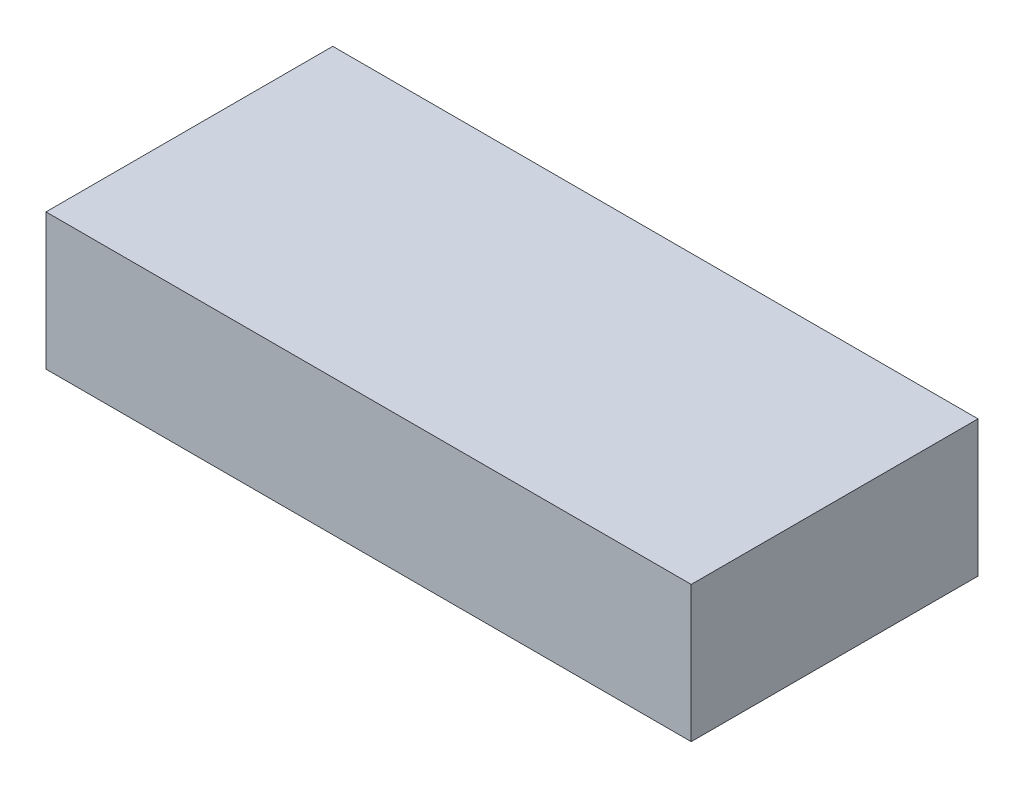
ISO-10303-21;
HEADER;
FILE_DESCRIPTION(('STEP AP214'),'2;1');
FILE_NAME('part.step','',(''),(''),'','','');
FILE_SCHEMA(('AUTOMOTIVE_DESIGN { 1 0 10303 214 1 1 1 1 }'));
ENDSEC;
DATA;
#1=APPLICATION_CONTEXT('core data for automotive mechanical design processes');
#2=APPLICATION_PROTOCOL_DEFINITION('international standard','automotive_design',2000,#1);
#3=PRODUCT_CONTEXT('',#1,'mechanical');
#4=PRODUCT('Part','Part','',(#3));
#5=PRODUCT_RELATED_PRODUCT_CATEGORY('part','',(#4));
#6=PRODUCT_DEFINITION_FORMATION('','',#4);
#7=PRODUCT_DEFINITION_CONTEXT('part definition',#1,'design');
#8=PRODUCT_DEFINITION('design','',#6,#7);
#9=PRODUCT_DEFINITION_SHAPE('','',#8);
#10=(LENGTH_UNIT() NAMED_UNIT(*) SI_UNIT(.MILLI.,.METRE.));
#11=(NAMED_UNIT(*) PLANE_ANGLE_UNIT() SI_UNIT($,.RADIAN.));
#12=(NAMED_UNIT(*) SI_UNIT($,.STERADIAN.) SOLID_ANGLE_UNIT());
#13=UNCERTAINTY_MEASURE_WITH_UNIT(LENGTH_MEASURE(1.E-05),#10,'distance_accuracy_value','');
#14=(GEOMETRIC_REPRESENTATION_CONTEXT(3) GLOBAL_UNCERTAINTY_ASSIGNED_CONTEXT((#13)) GLOBAL_UNIT_ASSIGNED_CONTEXT((#10,
#11,#12)) REPRESENTATION_CONTEXT('',''));
#15=CARTESIAN_POINT('',(0.,0.,0.));
#16=DIRECTION('',(0.,0.,1.));
#17=DIRECTION('',(1.,0.,0.));
#18=AXIS2_PLACEMENT_3D('',#15,#16,#17);
#19=CARTESIAN_POINT('',(0.,19.,0.));
#20=DIRECTION('',(1.,0.,0.));
#21=DIRECTION('',(0.,0.,-1.));
#22=AXIS2_PLACEMENT_3D('',#19,#20,#21);
#23=PLANE('',#22);
#24=DIRECTION('',(0.,0.,1.));
#25=VECTOR('',#24,1.);
#26=CARTESIAN_POINT('',(0.,0.,0.));
#27=LINE('',#26,#25);
#28=CARTESIAN_POINT('',(0.,0.,-40.));
#29=VERTEX_POINT('',#28);
#30=CARTESIAN_POINT('',(0.,0.,0.));
#31=VERTEX_POINT('',#30);
#32=EDGE_CURVE('E96',#29,#31,#27,.T.);
#33=ORIENTED_EDGE('',*,*,#32,.T.);
#34=DIRECTION('',(0.,-1.,0.));
#35=VECTOR('',#34,1.);
#36=CARTESIAN_POINT('',(0.,19.,0.));
#37=LINE('',#36,#35);
#38=CARTESIAN_POINT('',(0.,19.,0.));
#39=VERTEX_POINT('',#38);
#40=EDGE_CURVE('E11',#39,#31,#37,.T.);
#41=ORIENTED_EDGE('',*,*,#40,.F.);
#42=DIRECTION('',(0.,0.,1.));
#43=VECTOR('',#42,1.);
#44=CARTESIAN_POINT('',(0.,19.,0.));
#45=LINE('',#44,#43);
#46=CARTESIAN_POINT('',(0.,19.,-40.));
#47=VERTEX_POINT('',#46);
#48=EDGE_CURVE('E84',#47,#39,#45,.T.);
#49=ORIENTED_EDGE('',*,*,#48,.F.);
#50=DIRECTION('',(0.,-1.,0.));
#51=VECTOR('',#50,1.);
#52=CARTESIAN_POINT('',(0.,19.,-40.));
#53=LINE('',#52,#51);
#54=EDGE_CURVE('E92',#47,#29,#53,.T.);
#55=ORIENTED_EDGE('',*,*,#54,.T.);
#56=EDGE_LOOP('',(#33,#41,#49,#55));
#57=FACE_BOUND('',#56,.T.);
#58=ADVANCED_FACE('F33',(#57),#23,.F.);
#59=CARTESIAN_POINT('',(0.,19.,0.));
#60=DIRECTION('',(0.,0.,-1.));
#61=DIRECTION('',(-1.,0.,0.));
#62=AXIS2_PLACEMENT_3D('',#59,#60,#61);
#63=PLANE('',#62);
#64=DIRECTION('',(1.,0.,0.));
#65=VECTOR('',#64,1.);
#66=CARTESIAN_POINT('',(0.,0.,0.));
#67=LINE('',#66,#65);
#68=CARTESIAN_POINT('',(90.,0.,0.));
#69=VERTEX_POINT('',#68);
#70=EDGE_CURVE('E88',#31,#69,#67,.T.);
#71=ORIENTED_EDGE('',*,*,#70,.T.);
#72=DIRECTION('',(0.,-1.,0.));
#73=VECTOR('',#72,1.);
#74=CARTESIAN_POINT('',(90.,19.,0.));
#75=LINE('',#74,#73);
#76=CARTESIAN_POINT('',(90.,19.,0.));
#77=VERTEX_POINT('',#76);
#78=EDGE_CURVE('E41',#77,#69,#75,.T.);
#79=ORIENTED_EDGE('',*,*,#78,.F.);
#80=DIRECTION('',(1.,0.,0.));
#81=VECTOR('',#80,1.);
#82=CARTESIAN_POINT('',(0.,19.,0.));
#83=LINE('',#82,#81);
#84=EDGE_CURVE('E79',#39,#77,#83,.T.);
#85=ORIENTED_EDGE('',*,*,#84,.F.);
#86=ORIENTED_EDGE('',*,*,#40,.T.);
#87=EDGE_LOOP('',(#71,#79,#85,#86));
#88=FACE_BOUND('',#87,.T.);
#89=ADVANCED_FACE('F87',(#88),#63,.F.);
#90=CARTESIAN_POINT('',(90.,19.,0.));
#91=DIRECTION('',(-1.,0.,0.));
#92=DIRECTION('',(0.,0.,1.));
#93=AXIS2_PLACEMENT_3D('',#90,#91,#92);
#94=PLANE('',#93);
#95=DIRECTION('',(0.,0.,-1.));
#96=VECTOR('',#95,1.);
#97=CARTESIAN_POINT('',(90.,0.,0.));
#98=LINE('',#97,#96);
#99=CARTESIAN_POINT('',(90.,0.,-40.));
#100=VERTEX_POINT('',#99);
#101=EDGE_CURVE('E66',#69,#100,#98,.T.);
#102=ORIENTED_EDGE('',*,*,#101,.T.);
#103=DIRECTION('',(0.,-1.,0.));
#104=VECTOR('',#103,1.);
#105=CARTESIAN_POINT('',(90.,19.,-40.));
#106=LINE('',#105,#104);
#107=CARTESIAN_POINT('',(90.,19.,-40.));
#108=VERTEX_POINT('',#107);
#109=EDGE_CURVE('E89',#108,#100,#106,.T.);
#110=ORIENTED_EDGE('',*,*,#109,.F.);
#111=DIRECTION('',(0.,0.,-1.));
#112=VECTOR('',#111,1.);
#113=CARTESIAN_POINT('',(90.,19.,0.));
#114=LINE('',#113,#112);
#115=EDGE_CURVE('E82',#77,#108,#114,.T.);
#116=ORIENTED_EDGE('',*,*,#115,.F.);
#117=ORIENTED_EDGE('',*,*,#78,.T.);
#118=EDGE_LOOP('',(#102,#110,#116,#117));
#119=FACE_BOUND('',#118,.T.);
#120=ADVANCED_FACE('F90',(#119),#94,.F.);
#121=CARTESIAN_POINT('',(0.,19.,-40.));
#122=DIRECTION('',(0.,0.,1.));
#123=DIRECTION('',(1.,0.,0.));
#124=AXIS2_PLACEMENT_3D('',#121,#122,#123);
#125=PLANE('',#124);
#126=DIRECTION('',(-1.,0.,0.));
#127=VECTOR('',#126,1.);
#128=CARTESIAN_POINT('',(0.,0.,-40.));
#129=LINE('',#128,#127);
#130=EDGE_CURVE('E72',#100,#29,#129,.T.);
#131=ORIENTED_EDGE('',*,*,#130,.T.);
#132=ORIENTED_EDGE('',*,*,#54,.F.);
#133=DIRECTION('',(-1.,0.,0.));
#134=VECTOR('',#133,1.);
#135=CARTESIAN_POINT('',(0.,19.,-40.));
#136=LINE('',#135,#134);
#137=EDGE_CURVE('E49',#108,#47,#136,.T.);
#138=ORIENTED_EDGE('',*,*,#137,.F.);
#139=ORIENTED_EDGE('',*,*,#109,.T.);
#140=EDGE_LOOP('',(#131,#132,#138,#139));
#141=FACE_BOUND('',#140,.T.);
#142=ADVANCED_FACE('F103',(#141),#125,.F.);
#143=CARTESIAN_POINT('',(0.,19.,0.));
#144=DIRECTION('',(0.,-1.,0.));
#145=DIRECTION('',(0.,0.,-1.));
#146=AXIS2_PLACEMENT_3D('',#143,#144,#145);
#147=PLANE('',#146);
#148=ORIENTED_EDGE('',*,*,#48,.T.);
#149=ORIENTED_EDGE('',*,*,#84,.T.);
#150=ORIENTED_EDGE('',*,*,#115,.T.);
#151=ORIENTED_EDGE('',*,*,#137,.T.);
#152=EDGE_LOOP('',(#148,#149,#150,#151));
#153=FACE_BOUND('',#152,.T.);
#154=ADVANCED_FACE('F80',(#153),#147,.F.);
#155=CARTESIAN_POINT('',(0.,0.,0.));
#156=DIRECTION('',(0.,-1.,0.));
#157=DIRECTION('',(0.,0.,-1.));
#158=AXIS2_PLACEMENT_3D('',#155,#156,#157);
#159=PLANE('',#158);
#160=ORIENTED_EDGE('',*,*,#32,.F.);
#161=ORIENTED_EDGE('',*,*,#130,.F.);
#162=ORIENTED_EDGE('',*,*,#101,.F.);
#163=ORIENTED_EDGE('',*,*,#70,.F.);
#164=EDGE_LOOP('',(#160,#161,#162,#163));
#165=FACE_BOUND('',#164,.T.);
#166=ADVANCED_FACE('F106',(#165),#159,.T.);
#167=CLOSED_SHELL('',(#58,#89,#120,#142,#154,#166));
#168=MANIFOLD_SOLID_BREP('B2',#167);
#169=ADVANCED_BREP_SHAPE_REPRESENTATION('',(#18,#168),#14);
#170=SHAPE_DEFINITION_REPRESENTATION(#9,#169);
ENDSEC;
END-ISO-10303-21;
